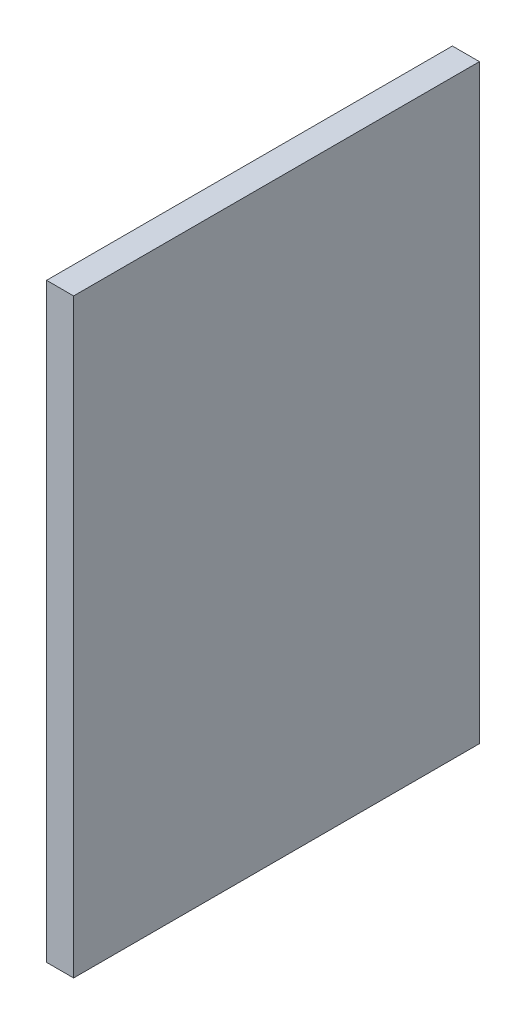
ISO-10303-21;
HEADER;
FILE_DESCRIPTION(('STEP AP214'),'2;1');
FILE_NAME('part.step','',(''),(''),'','','');
FILE_SCHEMA(('AUTOMOTIVE_DESIGN { 1 0 10303 214 1 1 1 1 }'));
ENDSEC;
DATA;
#1=APPLICATION_CONTEXT('core data for automotive mechanical design processes');
#2=APPLICATION_PROTOCOL_DEFINITION('international standard','automotive_design',2000,#1);
#3=PRODUCT_CONTEXT('',#1,'mechanical');
#4=PRODUCT('Part','Part','',(#3));
#5=PRODUCT_RELATED_PRODUCT_CATEGORY('part','',(#4));
#6=PRODUCT_DEFINITION_FORMATION('','',#4);
#7=PRODUCT_DEFINITION_CONTEXT('part definition',#1,'design');
#8=PRODUCT_DEFINITION('design','',#6,#7);
#9=PRODUCT_DEFINITION_SHAPE('','',#8);
#10=(LENGTH_UNIT() NAMED_UNIT(*) SI_UNIT(.MILLI.,.METRE.));
#11=(NAMED_UNIT(*) PLANE_ANGLE_UNIT() SI_UNIT($,.RADIAN.));
#12=(NAMED_UNIT(*) SI_UNIT($,.STERADIAN.) SOLID_ANGLE_UNIT());
#13=UNCERTAINTY_MEASURE_WITH_UNIT(LENGTH_MEASURE(1.E-05),#10,'distance_accuracy_value','');
#14=(GEOMETRIC_REPRESENTATION_CONTEXT(3) GLOBAL_UNCERTAINTY_ASSIGNED_CONTEXT((#13)) GLOBAL_UNIT_ASSIGNED_CONTEXT((#10,
#11,#12)) REPRESENTATION_CONTEXT('',''));
#15=CARTESIAN_POINT('',(0.,0.,0.));
#16=DIRECTION('',(0.,0.,1.));
#17=DIRECTION('',(1.,0.,0.));
#18=AXIS2_PLACEMENT_3D('',#15,#16,#17);
#19=CARTESIAN_POINT('',(60.4726077487484,311.149999999998,95.25));
#20=DIRECTION('',(-1.,0.,0.));
#21=DIRECTION('',(0.,0.,1.));
#22=AXIS2_PLACEMENT_3D('',#19,#20,#21);
#23=PLANE('',#22);
#24=DIRECTION('',(0.,1.,0.));
#25=VECTOR('',#24,1.);
#26=CARTESIAN_POINT('',(60.4726077487484,311.149999999998,0.));
#27=LINE('',#26,#25);
#28=CARTESIAN_POINT('',(60.4726077487484,172.511384416104,0.));
#29=VERTEX_POINT('',#28);
#30=CARTESIAN_POINT('',(60.4726077487484,311.149999999998,0.));
#31=VERTEX_POINT('',#30);
#32=EDGE_CURVE('E96',#29,#31,#27,.T.);
#33=ORIENTED_EDGE('',*,*,#32,.T.);
#34=DIRECTION('',(0.,0.,-1.));
#35=VECTOR('',#34,1.);
#36=CARTESIAN_POINT('',(60.4726077487484,311.149999999998,95.25));
#37=LINE('',#36,#35);
#38=CARTESIAN_POINT('',(60.4726077487484,311.149999999998,95.25));
#39=VERTEX_POINT('',#38);
#40=EDGE_CURVE('E11',#39,#31,#37,.T.);
#41=ORIENTED_EDGE('',*,*,#40,.F.);
#42=DIRECTION('',(0.,1.,0.));
#43=VECTOR('',#42,1.);
#44=CARTESIAN_POINT('',(60.4726077487484,311.149999999998,95.25));
#45=LINE('',#44,#43);
#46=CARTESIAN_POINT('',(60.4726077487484,172.511384416104,95.25));
#47=VERTEX_POINT('',#46);
#48=EDGE_CURVE('E84',#47,#39,#45,.T.);
#49=ORIENTED_EDGE('',*,*,#48,.F.);
#50=DIRECTION('',(0.,0.,-1.));
#51=VECTOR('',#50,1.);
#52=CARTESIAN_POINT('',(60.4726077487484,172.511384416104,95.25));
#53=LINE('',#52,#51);
#54=EDGE_CURVE('E92',#47,#29,#53,.T.);
#55=ORIENTED_EDGE('',*,*,#54,.T.);
#56=EDGE_LOOP('',(#33,#41,#49,#55));
#57=FACE_BOUND('',#56,.T.);
#58=ADVANCED_FACE('F33',(#57),#23,.F.);
#59=CARTESIAN_POINT('',(60.4726077487484,311.149999999998,95.25));
#60=DIRECTION('',(-8.11249580198539E-12,-1.,0.));
#61=DIRECTION('',(1.,-8.11249580198539E-12,0.));
#62=AXIS2_PLACEMENT_3D('',#59,#60,#61);
#63=PLANE('',#62);
#64=DIRECTION('',(-1.,8.11249580198539E-12,0.));
#65=VECTOR('',#64,1.);
#66=CARTESIAN_POINT('',(60.4726077487484,311.149999999998,0.));
#67=LINE('',#66,#65);
#68=CARTESIAN_POINT('',(54.1226077487484,311.150000000049,0.));
#69=VERTEX_POINT('',#68);
#70=EDGE_CURVE('E88',#31,#69,#67,.T.);
#71=ORIENTED_EDGE('',*,*,#70,.T.);
#72=DIRECTION('',(0.,0.,-1.));
#73=VECTOR('',#72,1.);
#74=CARTESIAN_POINT('',(54.1226077487484,311.150000000049,95.25));
#75=LINE('',#74,#73);
#76=CARTESIAN_POINT('',(54.1226077487484,311.150000000049,95.25));
#77=VERTEX_POINT('',#76);
#78=EDGE_CURVE('E41',#77,#69,#75,.T.);
#79=ORIENTED_EDGE('',*,*,#78,.F.);
#80=DIRECTION('',(-1.,8.11249580198539E-12,0.));
#81=VECTOR('',#80,1.);
#82=CARTESIAN_POINT('',(60.4726077487484,311.149999999998,95.25));
#83=LINE('',#82,#81);
#84=EDGE_CURVE('E79',#39,#77,#83,.T.);
#85=ORIENTED_EDGE('',*,*,#84,.F.);
#86=ORIENTED_EDGE('',*,*,#40,.T.);
#87=EDGE_LOOP('',(#71,#79,#85,#86));
#88=FACE_BOUND('',#87,.T.);
#89=ADVANCED_FACE('F87',(#88),#63,.F.);
#90=CARTESIAN_POINT('',(54.1226077487484,311.150000000049,95.25));
#91=DIRECTION('',(1.,0.,0.));
#92=DIRECTION('',(0.,1.,0.));
#93=AXIS2_PLACEMENT_3D('',#90,#91,#92);
#94=PLANE('',#93);
#95=DIRECTION('',(0.,-1.,0.));
#96=VECTOR('',#95,1.);
#97=CARTESIAN_POINT('',(54.1226077487484,311.150000000049,0.));
#98=LINE('',#97,#96);
#99=CARTESIAN_POINT('',(54.1226077487484,172.511384416104,0.));
#100=VERTEX_POINT('',#99);
#101=EDGE_CURVE('E66',#69,#100,#98,.T.);
#102=ORIENTED_EDGE('',*,*,#101,.T.);
#103=DIRECTION('',(0.,0.,-1.));
#104=VECTOR('',#103,1.);
#105=CARTESIAN_POINT('',(54.1226077487484,172.511384416104,95.25));
#106=LINE('',#105,#104);
#107=CARTESIAN_POINT('',(54.1226077487484,172.511384416104,95.25));
#108=VERTEX_POINT('',#107);
#109=EDGE_CURVE('E89',#108,#100,#106,.T.);
#110=ORIENTED_EDGE('',*,*,#109,.F.);
#111=DIRECTION('',(0.,-1.,0.));
#112=VECTOR('',#111,1.);
#113=CARTESIAN_POINT('',(54.1226077487484,311.150000000049,95.25));
#114=LINE('',#113,#112);
#115=EDGE_CURVE('E82',#77,#108,#114,.T.);
#116=ORIENTED_EDGE('',*,*,#115,.F.);
#117=ORIENTED_EDGE('',*,*,#78,.T.);
#118=EDGE_LOOP('',(#102,#110,#116,#117));
#119=FACE_BOUND('',#118,.T.);
#120=ADVANCED_FACE('F90',(#119),#94,.F.);
#121=CARTESIAN_POINT('',(60.4726077487484,172.511384416104,95.25));
#122=DIRECTION('',(0.,1.,0.));
#123=DIRECTION('',(0.,0.,1.));
#124=AXIS2_PLACEMENT_3D('',#121,#122,#123);
#125=PLANE('',#124);
#126=DIRECTION('',(1.,0.,0.));
#127=VECTOR('',#126,1.);
#128=CARTESIAN_POINT('',(60.4726077487484,172.511384416104,0.));
#129=LINE('',#128,#127);
#130=EDGE_CURVE('E72',#100,#29,#129,.T.);
#131=ORIENTED_EDGE('',*,*,#130,.T.);
#132=ORIENTED_EDGE('',*,*,#54,.F.);
#133=DIRECTION('',(1.,0.,0.));
#134=VECTOR('',#133,1.);
#135=CARTESIAN_POINT('',(60.4726077487484,172.511384416104,95.25));
#136=LINE('',#135,#134);
#137=EDGE_CURVE('E49',#108,#47,#136,.T.);
#138=ORIENTED_EDGE('',*,*,#137,.F.);
#139=ORIENTED_EDGE('',*,*,#109,.T.);
#140=EDGE_LOOP('',(#131,#132,#138,#139));
#141=FACE_BOUND('',#140,.T.);
#142=ADVANCED_FACE('F103',(#141),#125,.F.);
#143=CARTESIAN_POINT('',(0.,0.,95.25));
#144=DIRECTION('',(0.,0.,-1.));
#145=DIRECTION('',(-1.,0.,0.));
#146=AXIS2_PLACEMENT_3D('',#143,#144,#145);
#147=PLANE('',#146);
#148=ORIENTED_EDGE('',*,*,#48,.T.);
#149=ORIENTED_EDGE('',*,*,#84,.T.);
#150=ORIENTED_EDGE('',*,*,#115,.T.);
#151=ORIENTED_EDGE('',*,*,#137,.T.);
#152=EDGE_LOOP('',(#148,#149,#150,#151));
#153=FACE_BOUND('',#152,.T.);
#154=ADVANCED_FACE('F80',(#153),#147,.F.);
#155=CARTESIAN_POINT('',(0.,0.,0.));
#156=DIRECTION('',(0.,0.,-1.));
#157=DIRECTION('',(-1.,0.,0.));
#158=AXIS2_PLACEMENT_3D('',#155,#156,#157);
#159=PLANE('',#158);
#160=ORIENTED_EDGE('',*,*,#32,.F.);
#161=ORIENTED_EDGE('',*,*,#130,.F.);
#162=ORIENTED_EDGE('',*,*,#101,.F.);
#163=ORIENTED_EDGE('',*,*,#70,.F.);
#164=EDGE_LOOP('',(#160,#161,#162,#163));
#165=FACE_BOUND('',#164,.T.);
#166=ADVANCED_FACE('F106',(#165),#159,.T.);
#167=CLOSED_SHELL('',(#58,#89,#120,#142,#154,#166));
#168=MANIFOLD_SOLID_BREP('B2',#167);
#169=ADVANCED_BREP_SHAPE_REPRESENTATION('',(#18,#168),#14);
#170=SHAPE_DEFINITION_REPRESENTATION(#9,#169);
ENDSEC;
END-ISO-10303-21;
